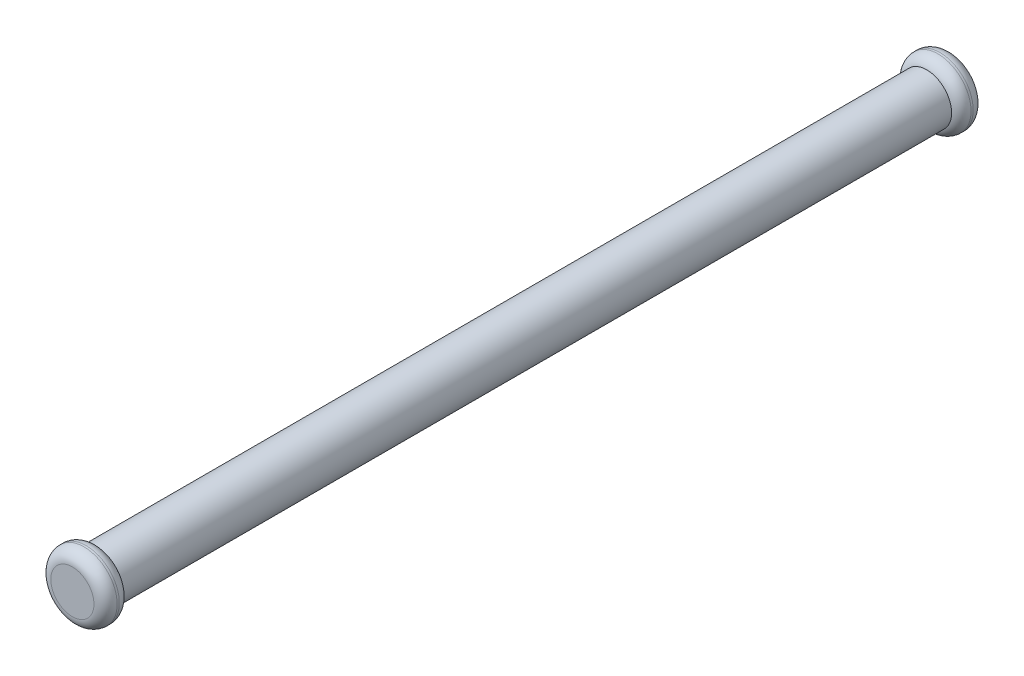
ISO-10303-21;
HEADER;
FILE_DESCRIPTION(('STEP AP214'),'2;1');
FILE_NAME('part.step','',(''),(''),'','','');
FILE_SCHEMA(('AUTOMOTIVE_DESIGN { 1 0 10303 214 1 1 1 1 }'));
ENDSEC;
DATA;
#1=APPLICATION_CONTEXT('core data for automotive mechanical design processes');
#2=APPLICATION_PROTOCOL_DEFINITION('international standard','automotive_design',2000,#1);
#3=PRODUCT_CONTEXT('',#1,'mechanical');
#4=PRODUCT('Part','Part','',(#3));
#5=PRODUCT_RELATED_PRODUCT_CATEGORY('part','',(#4));
#6=PRODUCT_DEFINITION_FORMATION('','',#4);
#7=PRODUCT_DEFINITION_CONTEXT('part definition',#1,'design');
#8=PRODUCT_DEFINITION('design','',#6,#7);
#9=PRODUCT_DEFINITION_SHAPE('','',#8);
#10=(LENGTH_UNIT() NAMED_UNIT(*) SI_UNIT(.MILLI.,.METRE.));
#11=(NAMED_UNIT(*) PLANE_ANGLE_UNIT() SI_UNIT($,.RADIAN.));
#12=(NAMED_UNIT(*) SI_UNIT($,.STERADIAN.) SOLID_ANGLE_UNIT());
#13=UNCERTAINTY_MEASURE_WITH_UNIT(LENGTH_MEASURE(1.E-05),#10,'distance_accuracy_value','');
#14=(GEOMETRIC_REPRESENTATION_CONTEXT(3) GLOBAL_UNCERTAINTY_ASSIGNED_CONTEXT((#13)) GLOBAL_UNIT_ASSIGNED_CONTEXT((#10,
#11,#12)) REPRESENTATION_CONTEXT('',''));
#15=CARTESIAN_POINT('',(0.,0.,0.));
#16=DIRECTION('',(0.,0.,1.));
#17=DIRECTION('',(1.,0.,0.));
#18=AXIS2_PLACEMENT_3D('',#15,#16,#17);
#19=CARTESIAN_POINT('',(-20.,2.50000000000001,-54.2426406871193));
#20=DIRECTION('',(0.,0.,1.));
#21=DIRECTION('',(1.,0.,0.));
#22=AXIS2_PLACEMENT_3D('',#19,#20,#21);
#23=CYLINDRICAL_SURFACE('',#22,1.5);
#24=CARTESIAN_POINT('',(-20.,2.50000000000001,0.));
#25=DIRECTION('',(0.,0.,1.));
#26=DIRECTION('',(1.,0.,0.));
#27=AXIS2_PLACEMENT_3D('',#24,#25,#26);
#28=CIRCLE('',#27,1.5);
#29=CARTESIAN_POINT('',(-18.5,2.50000000000001,0.));
#30=VERTEX_POINT('',#29);
#31=EDGE_CURVE('E57',#30,#30,#28,.T.);
#32=ORIENTED_EDGE('',*,*,#31,.F.);
#33=EDGE_LOOP('',(#32));
#34=FACE_BOUND('',#33,.T.);
#35=CARTESIAN_POINT('',(-20.,2.50000000000001,-50.));
#36=DIRECTION('',(0.,0.,-1.));
#37=DIRECTION('',(-1.,0.,0.));
#38=AXIS2_PLACEMENT_3D('',#35,#36,#37);
#39=CIRCLE('',#38,1.5);
#40=CARTESIAN_POINT('',(-21.5,2.50000000000001,-50.));
#41=VERTEX_POINT('',#40);
#42=EDGE_CURVE('E58',#41,#41,#39,.F.);
#43=ORIENTED_EDGE('',*,*,#42,.T.);
#44=EDGE_LOOP('',(#43));
#45=FACE_BOUND('',#44,.T.);
#46=ADVANCED_FACE('F31',(#34,#45),#23,.T.);
#47=CARTESIAN_POINT('',(-20.,2.50000000000001,1.5));
#48=DIRECTION('',(0.,0.,-1.));
#49=DIRECTION('',(-1.,0.,0.));
#50=AXIS2_PLACEMENT_3D('',#47,#48,#49);
#51=CYLINDRICAL_SURFACE('',#50,2.);
#52=CARTESIAN_POINT('',(-20.,2.50000000000001,0.670820393249936));
#53=DIRECTION('',(0.,0.,-1.));
#54=DIRECTION('',(-1.,0.,0.));
#55=AXIS2_PLACEMENT_3D('',#52,#53,#54);
#56=CIRCLE('',#55,2.);
#57=CARTESIAN_POINT('',(-22.,2.50000000000001,0.670820393249936));
#58=VERTEX_POINT('',#57);
#59=EDGE_CURVE('E38',#58,#58,#56,.F.);
#60=ORIENTED_EDGE('',*,*,#59,.T.);
#61=EDGE_LOOP('',(#60));
#62=FACE_BOUND('',#61,.T.);
#63=CARTESIAN_POINT('',(-20.,2.50000000000001,0.8));
#64=DIRECTION('',(0.,0.,1.));
#65=DIRECTION('',(1.,0.,0.));
#66=AXIS2_PLACEMENT_3D('',#63,#64,#65);
#67=CIRCLE('',#66,2.);
#68=CARTESIAN_POINT('',(-18.,2.50000000000001,0.8));
#69=VERTEX_POINT('',#68);
#70=EDGE_CURVE('E42',#69,#69,#67,.F.);
#71=ORIENTED_EDGE('',*,*,#70,.T.);
#72=EDGE_LOOP('',(#71));
#73=FACE_BOUND('',#72,.T.);
#74=ADVANCED_FACE('F69',(#62,#73),#51,.T.);
#75=CARTESIAN_POINT('',(-20.,2.50000000000001,1.5));
#76=DIRECTION('',(0.,0.,1.));
#77=DIRECTION('',(1.,0.,0.));
#78=AXIS2_PLACEMENT_3D('',#75,#76,#77);
#79=PLANE('',#78);
#80=CARTESIAN_POINT('',(-20.,2.50000000000001,1.5));
#81=DIRECTION('',(0.,0.,1.));
#82=DIRECTION('',(1.,0.,0.));
#83=AXIS2_PLACEMENT_3D('',#80,#81,#82);
#84=CIRCLE('',#83,1.3);
#85=CARTESIAN_POINT('',(-18.7,2.50000000000001,1.5));
#86=VERTEX_POINT('',#85);
#87=EDGE_CURVE('E10',#86,#86,#84,.T.);
#88=ORIENTED_EDGE('',*,*,#87,.T.);
#89=EDGE_LOOP('',(#88));
#90=FACE_BOUND('',#89,.T.);
#91=ADVANCED_FACE('F84',(#90),#79,.T.);
#92=CARTESIAN_POINT('',(-20.,2.50000000000001,-51.5));
#93=DIRECTION('',(0.,0.,1.));
#94=DIRECTION('',(1.,0.,0.));
#95=AXIS2_PLACEMENT_3D('',#92,#93,#94);
#96=CYLINDRICAL_SURFACE('',#95,2.);
#97=CARTESIAN_POINT('',(-20.,2.50000000000001,-50.6708203932499));
#98=DIRECTION('',(0.,0.,1.));
#99=DIRECTION('',(1.,0.,0.));
#100=AXIS2_PLACEMENT_3D('',#97,#98,#99);
#101=CIRCLE('',#100,2.);
#102=CARTESIAN_POINT('',(-18.,2.50000000000001,-50.6708203932499));
#103=VERTEX_POINT('',#102);
#104=EDGE_CURVE('E51',#103,#103,#101,.F.);
#105=ORIENTED_EDGE('',*,*,#104,.T.);
#106=EDGE_LOOP('',(#105));
#107=FACE_BOUND('',#106,.T.);
#108=CARTESIAN_POINT('',(-20.,2.50000000000001,-50.8));
#109=DIRECTION('',(0.,0.,-1.));
#110=DIRECTION('',(-1.,0.,0.));
#111=AXIS2_PLACEMENT_3D('',#108,#109,#110);
#112=CIRCLE('',#111,2.);
#113=CARTESIAN_POINT('',(-22.,2.50000000000001,-50.8));
#114=VERTEX_POINT('',#113);
#115=EDGE_CURVE('E54',#114,#114,#112,.F.);
#116=ORIENTED_EDGE('',*,*,#115,.T.);
#117=EDGE_LOOP('',(#116));
#118=FACE_BOUND('',#117,.T.);
#119=ADVANCED_FACE('F81',(#107,#118),#96,.T.);
#120=CARTESIAN_POINT('',(-20.,2.50000000000001,-51.5));
#121=DIRECTION('',(0.,0.,-1.));
#122=DIRECTION('',(-1.,0.,0.));
#123=AXIS2_PLACEMENT_3D('',#120,#121,#122);
#124=PLANE('',#123);
#125=CARTESIAN_POINT('',(-20.,2.50000000000001,-51.5));
#126=DIRECTION('',(0.,0.,-1.));
#127=DIRECTION('',(-1.,0.,0.));
#128=AXIS2_PLACEMENT_3D('',#125,#126,#127);
#129=CIRCLE('',#128,1.3);
#130=CARTESIAN_POINT('',(-21.3,2.50000000000001,-51.5));
#131=VERTEX_POINT('',#130);
#132=EDGE_CURVE('E46',#131,#131,#129,.T.);
#133=ORIENTED_EDGE('',*,*,#132,.T.);
#134=EDGE_LOOP('',(#133));
#135=FACE_BOUND('',#134,.T.);
#136=ADVANCED_FACE('F77',(#135),#124,.T.);
#137=CARTESIAN_POINT('',(-20.,2.50000000000001,-50.6708203932499));
#138=DIRECTION('',(0.,0.,1.));
#139=DIRECTION('',(1.,0.,0.));
#140=AXIS2_PLACEMENT_3D('',#137,#138,#139);
#141=TOROIDAL_SURFACE('',#140,1.3,0.7);
#142=ORIENTED_EDGE('',*,*,#42,.F.);
#143=EDGE_LOOP('',(#142));
#144=FACE_BOUND('',#143,.T.);
#145=ORIENTED_EDGE('',*,*,#104,.F.);
#146=EDGE_LOOP('',(#145));
#147=FACE_BOUND('',#146,.T.);
#148=ADVANCED_FACE('F73',(#144,#147),#141,.T.);
#149=CARTESIAN_POINT('',(-20.,2.50000000000001,-50.8));
#150=DIRECTION('',(0.,0.,-1.));
#151=DIRECTION('',(-1.,0.,0.));
#152=AXIS2_PLACEMENT_3D('',#149,#150,#151);
#153=TOROIDAL_SURFACE('',#152,1.3,0.7);
#154=ORIENTED_EDGE('',*,*,#115,.F.);
#155=EDGE_LOOP('',(#154));
#156=FACE_BOUND('',#155,.T.);
#157=ORIENTED_EDGE('',*,*,#132,.F.);
#158=EDGE_LOOP('',(#157));
#159=FACE_BOUND('',#158,.T.);
#160=ADVANCED_FACE('F76',(#156,#159),#153,.T.);
#161=CARTESIAN_POINT('',(-20.,2.50000000000001,0.670820393249936));
#162=DIRECTION('',(0.,0.,-1.));
#163=DIRECTION('',(-1.,0.,0.));
#164=AXIS2_PLACEMENT_3D('',#161,#162,#163);
#165=TOROIDAL_SURFACE('',#164,1.3,0.7);
#166=ORIENTED_EDGE('',*,*,#31,.T.);
#167=EDGE_LOOP('',(#166));
#168=FACE_BOUND('',#167,.T.);
#169=ORIENTED_EDGE('',*,*,#59,.F.);
#170=EDGE_LOOP('',(#169));
#171=FACE_BOUND('',#170,.T.);
#172=ADVANCED_FACE('F64',(#168,#171),#165,.T.);
#173=CARTESIAN_POINT('',(-20.,2.50000000000001,0.8));
#174=DIRECTION('',(0.,0.,1.));
#175=DIRECTION('',(1.,0.,0.));
#176=AXIS2_PLACEMENT_3D('',#173,#174,#175);
#177=TOROIDAL_SURFACE('',#176,1.3,0.7);
#178=ORIENTED_EDGE('',*,*,#70,.F.);
#179=EDGE_LOOP('',(#178));
#180=FACE_BOUND('',#179,.T.);
#181=ORIENTED_EDGE('',*,*,#87,.F.);
#182=EDGE_LOOP('',(#181));
#183=FACE_BOUND('',#182,.T.);
#184=ADVANCED_FACE('F33',(#180,#183),#177,.T.);
#185=CLOSED_SHELL('',(#46,#74,#91,#119,#136,#148,#160,#172,#184));
#186=MANIFOLD_SOLID_BREP('B2',#185);
#187=ADVANCED_BREP_SHAPE_REPRESENTATION('',(#18,#186),#14);
#188=SHAPE_DEFINITION_REPRESENTATION(#9,#187);
ENDSEC;
END-ISO-10303-21;
